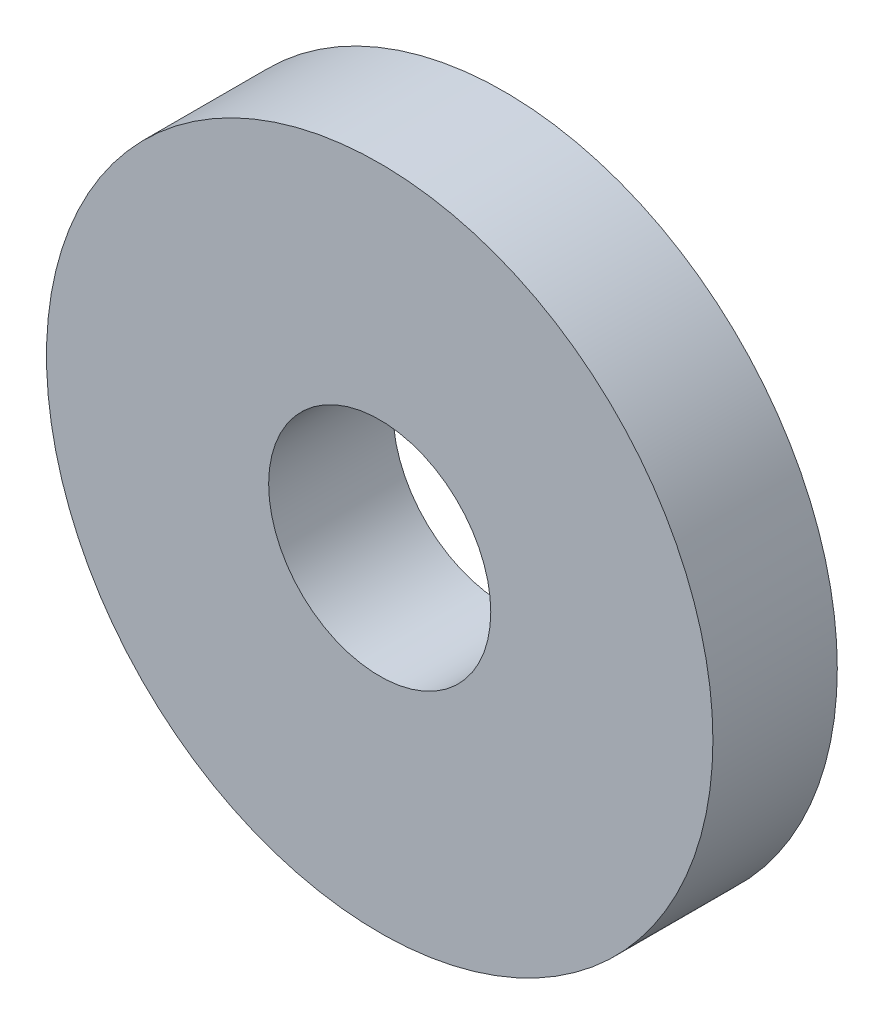
ISO-10303-21;
HEADER;
FILE_DESCRIPTION(('STEP AP214'),'2;1');
FILE_NAME('part.step','',(''),(''),'','','');
FILE_SCHEMA(('AUTOMOTIVE_DESIGN { 1 0 10303 214 1 1 1 1 }'));
ENDSEC;
DATA;
#1=APPLICATION_CONTEXT('core data for automotive mechanical design processes');
#2=APPLICATION_PROTOCOL_DEFINITION('international standard','automotive_design',2000,#1);
#3=PRODUCT_CONTEXT('',#1,'mechanical');
#4=PRODUCT('Part','Part','',(#3));
#5=PRODUCT_RELATED_PRODUCT_CATEGORY('part','',(#4));
#6=PRODUCT_DEFINITION_FORMATION('','',#4);
#7=PRODUCT_DEFINITION_CONTEXT('part definition',#1,'design');
#8=PRODUCT_DEFINITION('design','',#6,#7);
#9=PRODUCT_DEFINITION_SHAPE('','',#8);
#10=(LENGTH_UNIT() NAMED_UNIT(*) SI_UNIT(.MILLI.,.METRE.));
#11=(NAMED_UNIT(*) PLANE_ANGLE_UNIT() SI_UNIT($,.RADIAN.));
#12=(NAMED_UNIT(*) SI_UNIT($,.STERADIAN.) SOLID_ANGLE_UNIT());
#13=UNCERTAINTY_MEASURE_WITH_UNIT(LENGTH_MEASURE(1.E-05),#10,'distance_accuracy_value','');
#14=(GEOMETRIC_REPRESENTATION_CONTEXT(3) GLOBAL_UNCERTAINTY_ASSIGNED_CONTEXT((#13)) GLOBAL_UNIT_ASSIGNED_CONTEXT((#10,
#11,#12)) REPRESENTATION_CONTEXT('',''));
#15=CARTESIAN_POINT('',(0.,0.,0.));
#16=DIRECTION('',(0.,0.,1.));
#17=DIRECTION('',(1.,0.,0.));
#18=AXIS2_PLACEMENT_3D('',#15,#16,#17);
#19=CARTESIAN_POINT('',(0.,0.,0.));
#20=DIRECTION('',(0.,0.,1.));
#21=DIRECTION('',(1.,0.,0.));
#22=AXIS2_PLACEMENT_3D('',#19,#20,#21);
#23=PLANE('',#22);
#24=CARTESIAN_POINT('',(0.,0.,0.));
#25=DIRECTION('',(0.,0.,1.));
#26=DIRECTION('',(1.,0.,0.));
#27=AXIS2_PLACEMENT_3D('',#24,#25,#26);
#28=CIRCLE('',#27,3.175);
#29=CARTESIAN_POINT('',(3.175,0.,0.));
#30=VERTEX_POINT('',#29);
#31=EDGE_CURVE('E30',#30,#30,#28,.F.);
#32=ORIENTED_EDGE('',*,*,#31,.T.);
#33=EDGE_LOOP('',(#32));
#34=FACE_BOUND('',#33,.T.);
#35=CARTESIAN_POINT('',(0.,0.,0.));
#36=DIRECTION('',(0.,0.,1.));
#37=DIRECTION('',(1.,0.,0.));
#38=AXIS2_PLACEMENT_3D('',#35,#36,#37);
#39=CIRCLE('',#38,9.525);
#40=CARTESIAN_POINT('',(9.525,0.,0.));
#41=VERTEX_POINT('',#40);
#42=EDGE_CURVE('E17',#41,#41,#39,.F.);
#43=ORIENTED_EDGE('',*,*,#42,.F.);
#44=EDGE_LOOP('',(#43));
#45=FACE_BOUND('',#44,.T.);
#46=ADVANCED_FACE('F14',(#34,#45),#23,.T.);
#47=CARTESIAN_POINT('',(0.,0.,-3.556));
#48=DIRECTION('',(0.,0.,1.));
#49=DIRECTION('',(1.,0.,0.));
#50=AXIS2_PLACEMENT_3D('',#47,#48,#49);
#51=CYLINDRICAL_SURFACE('',#50,9.525);
#52=ORIENTED_EDGE('',*,*,#42,.T.);
#53=EDGE_LOOP('',(#52));
#54=FACE_BOUND('',#53,.T.);
#55=CARTESIAN_POINT('',(0.,0.,-3.556));
#56=DIRECTION('',(0.,0.,1.));
#57=DIRECTION('',(1.,0.,0.));
#58=AXIS2_PLACEMENT_3D('',#55,#56,#57);
#59=CIRCLE('',#58,9.525);
#60=CARTESIAN_POINT('',(9.525,0.,-3.556));
#61=VERTEX_POINT('',#60);
#62=EDGE_CURVE('E22',#61,#61,#59,.T.);
#63=ORIENTED_EDGE('',*,*,#62,.T.);
#64=EDGE_LOOP('',(#63));
#65=FACE_BOUND('',#64,.T.);
#66=ADVANCED_FACE('F39',(#54,#65),#51,.T.);
#67=CARTESIAN_POINT('',(0.,0.,-3.556));
#68=DIRECTION('',(0.,0.,1.));
#69=DIRECTION('',(1.,0.,0.));
#70=AXIS2_PLACEMENT_3D('',#67,#68,#69);
#71=CYLINDRICAL_SURFACE('',#70,3.175);
#72=ORIENTED_EDGE('',*,*,#31,.F.);
#73=EDGE_LOOP('',(#72));
#74=FACE_BOUND('',#73,.T.);
#75=CARTESIAN_POINT('',(0.,0.,-3.556));
#76=DIRECTION('',(0.,0.,1.));
#77=DIRECTION('',(1.,0.,0.));
#78=AXIS2_PLACEMENT_3D('',#75,#76,#77);
#79=CIRCLE('',#78,3.175);
#80=CARTESIAN_POINT('',(3.175,0.,-3.556));
#81=VERTEX_POINT('',#80);
#82=EDGE_CURVE('E10',#81,#81,#79,.F.);
#83=ORIENTED_EDGE('',*,*,#82,.T.);
#84=EDGE_LOOP('',(#83));
#85=FACE_BOUND('',#84,.T.);
#86=ADVANCED_FACE('F47',(#74,#85),#71,.F.);
#87=CARTESIAN_POINT('',(0.,0.,-3.556));
#88=DIRECTION('',(0.,0.,1.));
#89=DIRECTION('',(1.,0.,0.));
#90=AXIS2_PLACEMENT_3D('',#87,#88,#89);
#91=PLANE('',#90);
#92=ORIENTED_EDGE('',*,*,#82,.F.);
#93=EDGE_LOOP('',(#92));
#94=FACE_BOUND('',#93,.T.);
#95=ORIENTED_EDGE('',*,*,#62,.F.);
#96=EDGE_LOOP('',(#95));
#97=FACE_BOUND('',#96,.T.);
#98=ADVANCED_FACE('F48',(#94,#97),#91,.F.);
#99=CLOSED_SHELL('',(#46,#66,#86,#98));
#100=MANIFOLD_SOLID_BREP('B1',#99);
#101=ADVANCED_BREP_SHAPE_REPRESENTATION('',(#18,#100),#14);
#102=SHAPE_DEFINITION_REPRESENTATION(#9,#101);
ENDSEC;
END-ISO-10303-21;
